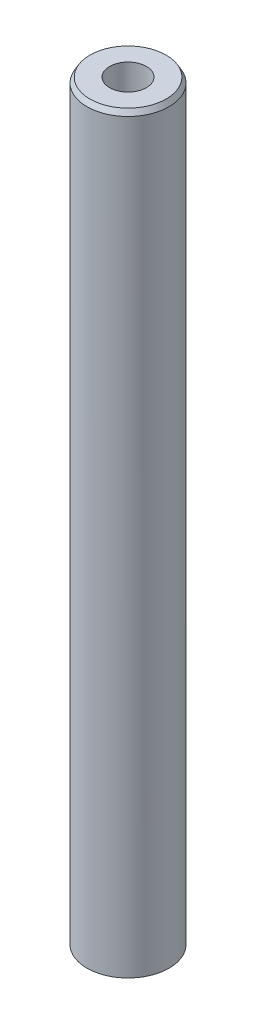
ISO-10303-21;
HEADER;
FILE_DESCRIPTION(('STEP AP214'),'2;1');
FILE_NAME('part.step','',(''),(''),'','','');
FILE_SCHEMA(('AUTOMOTIVE_DESIGN { 1 0 10303 214 1 1 1 1 }'));
ENDSEC;
DATA;
#1=APPLICATION_CONTEXT('core data for automotive mechanical design processes');
#2=APPLICATION_PROTOCOL_DEFINITION('international standard','automotive_design',2000,#1);
#3=PRODUCT_CONTEXT('',#1,'mechanical');
#4=PRODUCT('Part','Part','',(#3));
#5=PRODUCT_RELATED_PRODUCT_CATEGORY('part','',(#4));
#6=PRODUCT_DEFINITION_FORMATION('','',#4);
#7=PRODUCT_DEFINITION_CONTEXT('part definition',#1,'design');
#8=PRODUCT_DEFINITION('design','',#6,#7);
#9=PRODUCT_DEFINITION_SHAPE('','',#8);
#10=(LENGTH_UNIT() NAMED_UNIT(*) SI_UNIT(.MILLI.,.METRE.));
#11=(NAMED_UNIT(*) PLANE_ANGLE_UNIT() SI_UNIT($,.RADIAN.));
#12=(NAMED_UNIT(*) SI_UNIT($,.STERADIAN.) SOLID_ANGLE_UNIT());
#13=UNCERTAINTY_MEASURE_WITH_UNIT(LENGTH_MEASURE(1.E-05),#10,'distance_accuracy_value','');
#14=(GEOMETRIC_REPRESENTATION_CONTEXT(3) GLOBAL_UNCERTAINTY_ASSIGNED_CONTEXT((#13)) GLOBAL_UNIT_ASSIGNED_CONTEXT((#10,
#11,#12)) REPRESENTATION_CONTEXT('',''));
#15=CARTESIAN_POINT('',(0.,0.,0.));
#16=DIRECTION('',(0.,0.,1.));
#17=DIRECTION('',(1.,0.,0.));
#18=AXIS2_PLACEMENT_3D('',#15,#16,#17);
#19=CARTESIAN_POINT('',(0.,413.255893709129,0.));
#20=DIRECTION('',(0.,-1.,0.));
#21=DIRECTION('',(0.,0.,-1.));
#22=AXIS2_PLACEMENT_3D('',#19,#20,#21);
#23=CYLINDRICAL_SURFACE('',#22,22.5);
#24=CARTESIAN_POINT('',(0.,410.437350653944,0.));
#25=DIRECTION('',(0.,1.,0.));
#26=DIRECTION('',(0.,0.,1.));
#27=AXIS2_PLACEMENT_3D('',#24,#25,#26);
#28=CIRCLE('',#27,22.5);
#29=CARTESIAN_POINT('',(0.,410.437350653944,-22.5));
#30=VERTEX_POINT('',#29);
#31=EDGE_CURVE('E50',#30,#30,#28,.F.);
#32=CARTESIAN_POINT('',(0.,1.62728659163403,0.));
#33=DIRECTION('',(0.,1.,0.));
#34=DIRECTION('',(0.,0.,1.));
#35=AXIS2_PLACEMENT_3D('',#32,#33,#34);
#36=CIRCLE('',#35,22.5);
#37=CARTESIAN_POINT('',(0.,1.62728659163397,-22.5));
#38=VERTEX_POINT('',#37);
#39=EDGE_CURVE('E51',#38,#38,#36,.T.);
#40=CARTESIAN_POINT('',(0.,410.437350653944,-22.5));
#41=CARTESIAN_POINT('',(0.,406.178912486628,-22.5));
#42=CARTESIAN_POINT('',(0.,401.920474319312,-22.5));
#43=CARTESIAN_POINT('',(0.,393.403597984681,-22.5));
#44=CARTESIAN_POINT('',(0.,389.145159817365,-22.5));
#45=CARTESIAN_POINT('',(0.,380.628283482734,-22.5));
#46=CARTESIAN_POINT('',(0.,376.369845315418,-22.5));
#47=CARTESIAN_POINT('',(0.,367.852968980787,-22.5));
#48=CARTESIAN_POINT('',(0.,363.594530813471,-22.5));
#49=CARTESIAN_POINT('',(0.,355.077654478839,-22.5));
#50=CARTESIAN_POINT('',(0.,350.819216311524,-22.5));
#51=CARTESIAN_POINT('',(0.,342.302339976892,-22.5));
#52=CARTESIAN_POINT('',(0.,338.043901809577,-22.5));
#53=CARTESIAN_POINT('',(0.,329.527025474945,-22.5));
#54=CARTESIAN_POINT('',(0.,325.268587307629,-22.5));
#55=CARTESIAN_POINT('',(0.,316.751710972998,-22.5));
#56=CARTESIAN_POINT('',(0.,312.493272805682,-22.5));
#57=CARTESIAN_POINT('',(0.,303.976396471051,-22.5));
#58=CARTESIAN_POINT('',(0.,299.717958303735,-22.5));
#59=CARTESIAN_POINT('',(0.,291.201081969103,-22.5));
#60=CARTESIAN_POINT('',(0.,286.942643801788,-22.5));
#61=CARTESIAN_POINT('',(0.,278.425767467156,-22.5));
#62=CARTESIAN_POINT('',(0.,274.167329299841,-22.5));
#63=CARTESIAN_POINT('',(0.,265.650452965209,-22.5));
#64=CARTESIAN_POINT('',(0.,261.392014797893,-22.5));
#65=CARTESIAN_POINT('',(0.,252.875138463262,-22.5));
#66=CARTESIAN_POINT('',(0.,248.616700295946,-22.5));
#67=CARTESIAN_POINT('',(0.,240.099823961315,-22.5));
#68=CARTESIAN_POINT('',(0.,235.841385793999,-22.5));
#69=CARTESIAN_POINT('',(0.,227.324509459368,-22.5));
#70=CARTESIAN_POINT('',(0.,223.066071292052,-22.5));
#71=CARTESIAN_POINT('',(0.,214.54919495742,-22.5));
#72=CARTESIAN_POINT('',(0.,210.290756790105,-22.5));
#73=CARTESIAN_POINT('',(0.,201.773880455473,-22.5));
#74=CARTESIAN_POINT('',(0.,197.515442288157,-22.5));
#75=CARTESIAN_POINT('',(0.,188.998565953526,-22.5));
#76=CARTESIAN_POINT('',(0.,184.74012778621,-22.5));
#77=CARTESIAN_POINT('',(0.,176.223251451579,-22.5));
#78=CARTESIAN_POINT('',(0.,171.964813284263,-22.5));
#79=CARTESIAN_POINT('',(0.,163.447936949632,-22.5));
#80=CARTESIAN_POINT('',(0.,159.189498782316,-22.5));
#81=CARTESIAN_POINT('',(0.,150.672622447685,-22.5));
#82=CARTESIAN_POINT('',(0.,146.414184280369,-22.5));
#83=CARTESIAN_POINT('',(0.,137.897307945737,-22.5));
#84=CARTESIAN_POINT('',(0.,133.638869778422,-22.5));
#85=CARTESIAN_POINT('',(0.,125.12199344379,-22.5));
#86=CARTESIAN_POINT('',(0.,120.863555276474,-22.5));
#87=CARTESIAN_POINT('',(0.,112.346678941843,-22.5));
#88=CARTESIAN_POINT('',(0.,108.088240774527,-22.5));
#89=CARTESIAN_POINT('',(0.,99.5713644398957,-22.5));
#90=CARTESIAN_POINT('',(0.,95.31292627258,-22.5));
#91=CARTESIAN_POINT('',(0.,86.7960499379486,-22.5));
#92=CARTESIAN_POINT('',(0.,82.5376117706328,-22.5));
#93=CARTESIAN_POINT('',(0.,74.0207354360014,-22.5));
#94=CARTESIAN_POINT('',(0.,69.7622972686856,-22.5));
#95=CARTESIAN_POINT('',(0.,61.2454209340542,-22.5));
#96=CARTESIAN_POINT('',(0.,56.9869827667384,-22.5));
#97=CARTESIAN_POINT('',(0.,48.470106432107,-22.5));
#98=CARTESIAN_POINT('',(0.,44.2116682647913,-22.5));
#99=CARTESIAN_POINT('',(0.,35.6947919301598,-22.5));
#100=CARTESIAN_POINT('',(0.,31.4363537628441,-22.5));
#101=CARTESIAN_POINT('',(0.,22.9194774282126,-22.5));
#102=CARTESIAN_POINT('',(0.,18.6610392608969,-22.5));
#103=CARTESIAN_POINT('',(0.,10.1441629262654,-22.5));
#104=CARTESIAN_POINT('',(0.,5.8857247589497,-22.5));
#105=CARTESIAN_POINT('',(0.,1.62728659163397,-22.5));
#106=B_SPLINE_CURVE_WITH_KNOTS('',3,(#40,#41,#42,#43,#44,#45,#46,#47,#48,#49,#50,#51,#52,#53,
#54,#55,#56,#57,#58,#59,#60,#61,#62,#63,#64,#65,#66,#67,#68,#69,#70,#71,#72,#73,#74,#75,#76,#77,
#78,#79,#80,#81,#82,#83,#84,#85,#86,#87,#88,#89,#90,#91,#92,#93,#94,#95,#96,#97,#98,#99,#100,
#101,#102,#103,#104,#105),.UNSPECIFIED.,.F.,.F.,(4,2,2,2,2,2,2,2,2,2,2,2,2,2,2,2,2,2,2,2,2,2,2,
2,2,2,2,2,2,2,2,2,4),(0.,12.7753145019471,25.5506290038943,38.3259435058415,51.1012580077887,
63.8765725097359,76.6518870116831,89.4272015136303,102.202516015577,114.977830517525,
127.753145019472,140.528459521419,153.303774023366,166.079088525313,178.854403027261,
191.629717529208,204.405032031155,217.180346533102,229.955661035049,242.730975536996,
255.506290038944,268.281604540891,281.056919042838,293.832233544785,306.607548046732,
319.38286254868,332.158177050627,344.933491552574,357.708806054521,370.484120556468,
383.259435058416,396.034749560363,408.81006406231),.UNSPECIFIED.);
#107=EDGE_CURVE('BSEAM39',#30,#38,#106,.T.);
#108=ORIENTED_EDGE('',*,*,#31,.T.);
#109=ORIENTED_EDGE('',*,*,#39,.T.);
#110=ORIENTED_EDGE('',*,*,#107,.T.);
#111=ORIENTED_EDGE('',*,*,#107,.F.);
#112=EDGE_LOOP('',(#108,#110,#109,#111));
#113=FACE_BOUND('',#112,.T.);
#114=ADVANCED_FACE('F39',(#113),#23,.T.);
#115=CARTESIAN_POINT('',(0.,413.255893709129,0.));
#116=DIRECTION('',(0.,1.,0.));
#117=DIRECTION('',(0.,0.,1.));
#118=AXIS2_PLACEMENT_3D('',#115,#116,#117);
#119=PLANE('',#118);
#120=CARTESIAN_POINT('',(0.,413.255893709129,0.));
#121=DIRECTION('',(0.,1.,0.));
#122=DIRECTION('',(0.,0.,1.));
#123=AXIS2_PLACEMENT_3D('',#120,#121,#122);
#124=CIRCLE('',#123,20.8727134083662);
#125=CARTESIAN_POINT('',(0.,413.255893709129,20.8727134083662));
#126=VERTEX_POINT('',#125);
#127=EDGE_CURVE('E54',#126,#126,#124,.T.);
#128=ORIENTED_EDGE('',*,*,#127,.T.);
#129=EDGE_LOOP('',(#128));
#130=FACE_BOUND('',#129,.T.);
#131=CARTESIAN_POINT('',(0.,413.255893709129,0.));
#132=DIRECTION('',(0.,1.,0.));
#133=DIRECTION('',(0.,0.,1.));
#134=AXIS2_PLACEMENT_3D('',#131,#132,#133);
#135=CIRCLE('',#134,10.0917049425718);
#136=CARTESIAN_POINT('',(0.,413.255893709129,-10.0917049425718));
#137=VERTEX_POINT('',#136);
#138=EDGE_CURVE('E58',#137,#137,#135,.T.);
#139=ORIENTED_EDGE('',*,*,#138,.F.);
#140=EDGE_LOOP('',(#139));
#141=FACE_BOUND('',#140,.T.);
#142=ADVANCED_FACE('F69',(#130,#141),#119,.T.);
#143=CARTESIAN_POINT('',(0.,0.,0.));
#144=DIRECTION('',(0.,1.,0.));
#145=DIRECTION('',(0.,0.,1.));
#146=AXIS2_PLACEMENT_3D('',#143,#144,#145);
#147=PLANE('',#146);
#148=CARTESIAN_POINT('',(0.,0.,0.));
#149=DIRECTION('',(0.,1.,0.));
#150=DIRECTION('',(0.,0.,1.));
#151=AXIS2_PLACEMENT_3D('',#148,#149,#150);
#152=CIRCLE('',#151,19.6814569448143);
#153=CARTESIAN_POINT('',(0.,0.,19.6814569448143));
#154=VERTEX_POINT('',#153);
#155=EDGE_CURVE('E10',#154,#154,#152,.F.);
#156=ORIENTED_EDGE('',*,*,#155,.T.);
#157=EDGE_LOOP('',(#156));
#158=FACE_BOUND('',#157,.T.);
#159=CARTESIAN_POINT('',(0.,0.,0.));
#160=DIRECTION('',(0.,1.,0.));
#161=DIRECTION('',(0.,0.,1.));
#162=AXIS2_PLACEMENT_3D('',#159,#160,#161);
#163=CIRCLE('',#162,10.0917049425718);
#164=CARTESIAN_POINT('',(0.,0.,-10.0917049425718));
#165=VERTEX_POINT('',#164);
#166=EDGE_CURVE('E63',#165,#165,#163,.T.);
#167=ORIENTED_EDGE('',*,*,#166,.T.);
#168=EDGE_LOOP('',(#167));
#169=FACE_BOUND('',#168,.T.);
#170=ADVANCED_FACE('F75',(#158,#169),#147,.F.);
#171=CARTESIAN_POINT('',(0.,413.255893709129,0.));
#172=DIRECTION('',(0.,-1.,0.));
#173=DIRECTION('',(0.,0.,-1.));
#174=AXIS2_PLACEMENT_3D('',#171,#172,#173);
#175=CYLINDRICAL_SURFACE('',#174,10.0917049425718);
#176=CARTESIAN_POINT('',(0.,413.255893709129,-10.0917049425718));
#177=CARTESIAN_POINT('',(0.,408.951144816326,-10.0917049425718));
#178=CARTESIAN_POINT('',(0.,404.646395923522,-10.0917049425718));
#179=CARTESIAN_POINT('',(0.,396.036898137916,-10.0917049425718));
#180=CARTESIAN_POINT('',(0.,391.732149245112,-10.0917049425718));
#181=CARTESIAN_POINT('',(0.,383.122651459505,-10.0917049425718));
#182=CARTESIAN_POINT('',(0.,378.817902566702,-10.0917049425718));
#183=CARTESIAN_POINT('',(0.,370.208404781095,-10.0917049425718));
#184=CARTESIAN_POINT('',(0.,365.903655888292,-10.0917049425718));
#185=CARTESIAN_POINT('',(0.,357.294158102685,-10.0917049425718));
#186=CARTESIAN_POINT('',(0.,352.989409209881,-10.0917049425718));
#187=CARTESIAN_POINT('',(0.,344.379911424274,-10.0917049425718));
#188=CARTESIAN_POINT('',(0.,340.075162531471,-10.0917049425718));
#189=CARTESIAN_POINT('',(0.,331.465664745864,-10.0917049425718));
#190=CARTESIAN_POINT('',(0.,327.160915853061,-10.0917049425718));
#191=CARTESIAN_POINT('',(0.,318.551418067454,-10.0917049425718));
#192=CARTESIAN_POINT('',(0.,314.24666917465,-10.0917049425718));
#193=CARTESIAN_POINT('',(0.,305.637171389043,-10.0917049425718));
#194=CARTESIAN_POINT('',(0.,301.33242249624,-10.0917049425718));
#195=CARTESIAN_POINT('',(0.,292.722924710633,-10.0917049425718));
#196=CARTESIAN_POINT('',(0.,288.41817581783,-10.0917049425718));
#197=CARTESIAN_POINT('',(0.,279.808678032223,-10.0917049425718));
#198=CARTESIAN_POINT('',(0.,275.50392913942,-10.0917049425718));
#199=CARTESIAN_POINT('',(0.,266.894431353813,-10.0917049425718));
#200=CARTESIAN_POINT('',(0.,262.589682461009,-10.0917049425718));
#201=CARTESIAN_POINT('',(0.,253.980184675402,-10.0917049425718));
#202=CARTESIAN_POINT('',(0.,249.675435782599,-10.0917049425718));
#203=CARTESIAN_POINT('',(0.,241.065937996992,-10.0917049425718));
#204=CARTESIAN_POINT('',(0.,236.761189104189,-10.0917049425718));
#205=CARTESIAN_POINT('',(0.,228.151691318582,-10.0917049425718));
#206=CARTESIAN_POINT('',(0.,223.846942425778,-10.0917049425718));
#207=CARTESIAN_POINT('',(0.,215.237444640171,-10.0917049425718));
#208=CARTESIAN_POINT('',(0.,210.932695747368,-10.0917049425718));
#209=CARTESIAN_POINT('',(0.,202.323197961761,-10.0917049425718));
#210=CARTESIAN_POINT('',(0.,198.018449068958,-10.0917049425718));
#211=CARTESIAN_POINT('',(0.,189.408951283351,-10.0917049425718));
#212=CARTESIAN_POINT('',(0.,185.104202390547,-10.0917049425718));
#213=CARTESIAN_POINT('',(0.,176.494704604941,-10.0917049425718));
#214=CARTESIAN_POINT('',(0.,172.189955712137,-10.0917049425718));
#215=CARTESIAN_POINT('',(0.,163.58045792653,-10.0917049425718));
#216=CARTESIAN_POINT('',(0.,159.275709033727,-10.0917049425718));
#217=CARTESIAN_POINT('',(0.,150.66621124812,-10.0917049425718));
#218=CARTESIAN_POINT('',(0.,146.361462355317,-10.0917049425718));
#219=CARTESIAN_POINT('',(0.,137.75196456971,-10.0917049425718));
#220=CARTESIAN_POINT('',(0.,133.447215676906,-10.0917049425718));
#221=CARTESIAN_POINT('',(0.,124.837717891299,-10.0917049425718));
#222=CARTESIAN_POINT('',(0.,120.532968998496,-10.0917049425718));
#223=CARTESIAN_POINT('',(0.,111.923471212889,-10.0917049425718));
#224=CARTESIAN_POINT('',(0.,107.618722320086,-10.0917049425718));
#225=CARTESIAN_POINT('',(0.,99.0092245344788,-10.0917049425718));
#226=CARTESIAN_POINT('',(0.,94.7044756416754,-10.0917049425718));
#227=CARTESIAN_POINT('',(0.,86.0949778560686,-10.0917049425718));
#228=CARTESIAN_POINT('',(0.,81.7902289632651,-10.0917049425718));
#229=CARTESIAN_POINT('',(0.,73.1807311776583,-10.0917049425718));
#230=CARTESIAN_POINT('',(0.,68.8759822848548,-10.0917049425718));
#231=CARTESIAN_POINT('',(0.,60.266484499248,-10.0917049425718));
#232=CARTESIAN_POINT('',(0.,55.9617356064445,-10.0917049425718));
#233=CARTESIAN_POINT('',(0.,47.3522378208377,-10.0917049425718));
#234=CARTESIAN_POINT('',(0.,43.0474889280342,-10.0917049425718));
#235=CARTESIAN_POINT('',(0.,34.4379911424274,-10.0917049425718));
#236=CARTESIAN_POINT('',(0.,30.133242249624,-10.0917049425718));
#237=CARTESIAN_POINT('',(0.,21.5237444640171,-10.0917049425718));
#238=CARTESIAN_POINT('',(0.,17.2189955712137,-10.0917049425718));
#239=CARTESIAN_POINT('',(0.,8.6094977856068,-10.0917049425718));
#240=CARTESIAN_POINT('',(0.,4.30474889280337,-10.0917049425718));
#241=CARTESIAN_POINT('',(0.,0.,-10.0917049425718));
#242=B_SPLINE_CURVE_WITH_KNOTS('',3,(#176,#177,#178,#179,#180,#181,#182,#183,#184,#185,#186,
#187,#188,#189,#190,#191,#192,#193,#194,#195,#196,#197,#198,#199,#200,#201,#202,#203,#204,#205,
#206,#207,#208,#209,#210,#211,#212,#213,#214,#215,#216,#217,#218,#219,#220,#221,#222,#223,#224,
#225,#226,#227,#228,#229,#230,#231,#232,#233,#234,#235,#236,#237,#238,#239,#240,#241),
.UNSPECIFIED.,.F.,.F.,(4,2,2,2,2,2,2,2,2,2,2,2,2,2,2,2,2,2,2,2,2,2,2,2,2,2,2,2,2,2,2,2,4),(0.,
12.9142466784103,25.8284933568205,38.7427400352309,51.6569867136411,64.5712333920515,
77.4854800704617,90.399726748872,103.313973427282,116.228220105693,129.142466784103,
142.056713462513,154.970960140923,167.885206819334,180.799453497744,193.713700176154,
206.627946854565,219.542193532975,232.456440211385,245.370686889795,258.284933568206,
271.199180246616,284.113426925026,297.027673603437,309.941920281847,322.856166960257,
335.770413638668,348.684660317078,361.598906995488,374.513153673898,387.427400352309,
400.341647030719,413.255893709129),.UNSPECIFIED.);
#243=EDGE_CURVE('BSEAM70',#137,#165,#242,.T.);
#244=ORIENTED_EDGE('',*,*,#138,.T.);
#245=ORIENTED_EDGE('',*,*,#166,.F.);
#246=ORIENTED_EDGE('',*,*,#243,.T.);
#247=ORIENTED_EDGE('',*,*,#243,.F.);
#248=EDGE_LOOP('',(#244,#246,#245,#247));
#249=FACE_BOUND('',#248,.T.);
#250=ADVANCED_FACE('F70',(#249),#175,.F.);
#251=CARTESIAN_POINT('',(0.,413.255893709129,0.));
#252=DIRECTION('',(0.,-1.,0.));
#253=DIRECTION('',(0.,0.,-1.));
#254=AXIS2_PLACEMENT_3D('',#251,#252,#253);
#255=CONICAL_SURFACE('',#254,20.8727134083662,0.523598775598291);
#256=ORIENTED_EDGE('',*,*,#31,.F.);
#257=EDGE_LOOP('',(#256));
#258=FACE_BOUND('',#257,.T.);
#259=ORIENTED_EDGE('',*,*,#127,.F.);
#260=EDGE_LOOP('',(#259));
#261=FACE_BOUND('',#260,.T.);
#262=ADVANCED_FACE('F81',(#258,#261),#255,.T.);
#263=CARTESIAN_POINT('',(0.,1.62728659163403,0.));
#264=DIRECTION('',(0.,1.,0.));
#265=DIRECTION('',(0.,0.,1.));
#266=AXIS2_PLACEMENT_3D('',#263,#264,#265);
#267=CONICAL_SURFACE('',#266,22.5,1.0471975511966);
#268=ORIENTED_EDGE('',*,*,#155,.F.);
#269=EDGE_LOOP('',(#268));
#270=FACE_BOUND('',#269,.T.);
#271=ORIENTED_EDGE('',*,*,#39,.F.);
#272=EDGE_LOOP('',(#271));
#273=FACE_BOUND('',#272,.T.);
#274=ADVANCED_FACE('F45',(#270,#273),#267,.T.);
#275=CLOSED_SHELL('',(#114,#142,#170,#250,#262,#274));
#276=MANIFOLD_SOLID_BREP('B2',#275);
#277=ADVANCED_BREP_SHAPE_REPRESENTATION('',(#18,#276),#14);
#278=SHAPE_DEFINITION_REPRESENTATION(#9,#277);
ENDSEC;
END-ISO-10303-21;
